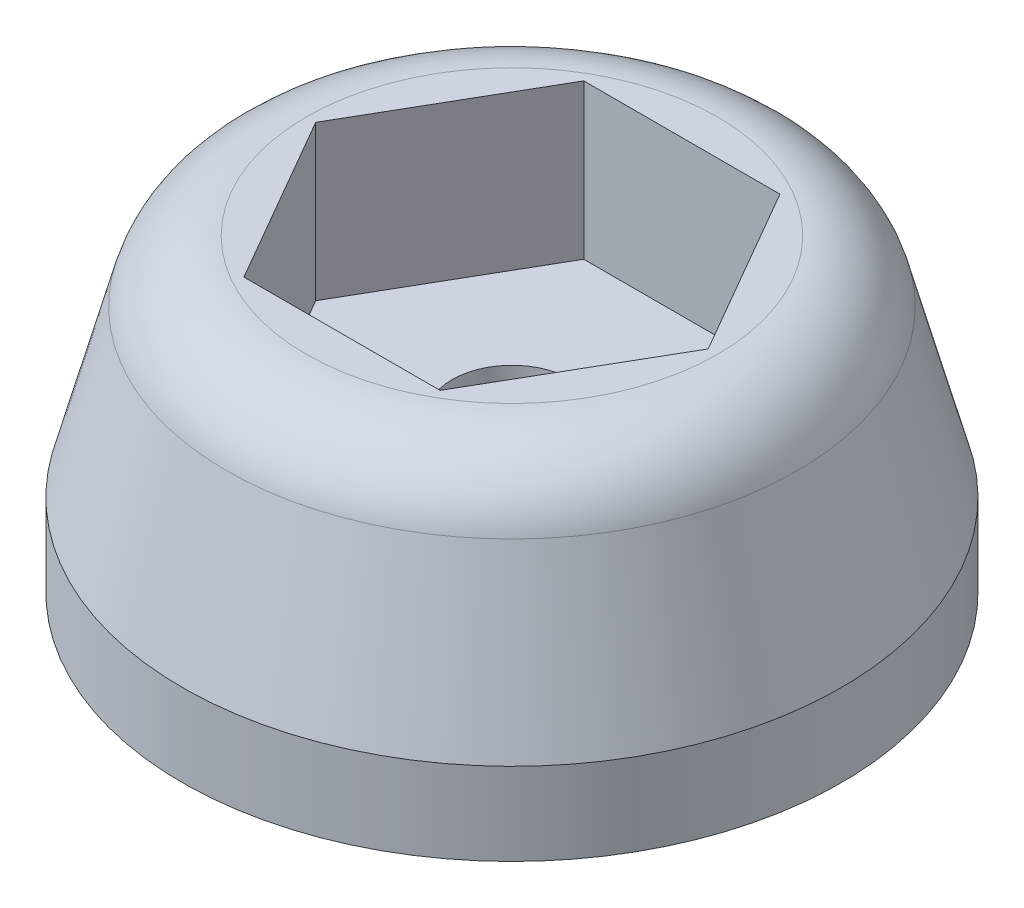
ISO-10303-21;
HEADER;
FILE_DESCRIPTION(('STEP AP214'),'2;1');
FILE_NAME('part.step','',(''),(''),'','','');
FILE_SCHEMA(('AUTOMOTIVE_DESIGN { 1 0 10303 214 1 1 1 1 }'));
ENDSEC;
DATA;
#1=APPLICATION_CONTEXT('core data for automotive mechanical design processes');
#2=APPLICATION_PROTOCOL_DEFINITION('international standard','automotive_design',2000,#1);
#3=PRODUCT_CONTEXT('',#1,'mechanical');
#4=PRODUCT('Part','Part','',(#3));
#5=PRODUCT_RELATED_PRODUCT_CATEGORY('part','',(#4));
#6=PRODUCT_DEFINITION_FORMATION('','',#4);
#7=PRODUCT_DEFINITION_CONTEXT('part definition',#1,'design');
#8=PRODUCT_DEFINITION('design','',#6,#7);
#9=PRODUCT_DEFINITION_SHAPE('','',#8);
#10=(LENGTH_UNIT() NAMED_UNIT(*) SI_UNIT(.MILLI.,.METRE.));
#11=(NAMED_UNIT(*) PLANE_ANGLE_UNIT() SI_UNIT($,.RADIAN.));
#12=(NAMED_UNIT(*) SI_UNIT($,.STERADIAN.) SOLID_ANGLE_UNIT());
#13=UNCERTAINTY_MEASURE_WITH_UNIT(LENGTH_MEASURE(1.E-05),#10,'distance_accuracy_value','');
#14=(GEOMETRIC_REPRESENTATION_CONTEXT(3) GLOBAL_UNCERTAINTY_ASSIGNED_CONTEXT((#13)) GLOBAL_UNIT_ASSIGNED_CONTEXT((#10,
#11,#12)) REPRESENTATION_CONTEXT('',''));
#15=CARTESIAN_POINT('',(0.,0.,0.));
#16=DIRECTION('',(0.,0.,1.));
#17=DIRECTION('',(1.,0.,0.));
#18=AXIS2_PLACEMENT_3D('',#15,#16,#17);
#19=CARTESIAN_POINT('',(0.,0.,0.));
#20=DIRECTION('',(0.,1.,0.));
#21=DIRECTION('',(-1.,0.,0.));
#22=AXIS2_PLACEMENT_3D('',#19,#20,#21);
#23=CYLINDRICAL_SURFACE('',#22,1.4732);
#24=CARTESIAN_POINT('',(0.,0.,0.));
#25=DIRECTION('',(0.,1.,0.));
#26=DIRECTION('',(-1.,0.,0.));
#27=AXIS2_PLACEMENT_3D('',#24,#25,#26);
#28=CIRCLE('',#27,1.4732);
#29=CARTESIAN_POINT('',(-1.4732,0.,0.));
#30=VERTEX_POINT('',#29);
#31=EDGE_CURVE('E11',#30,#30,#28,.T.);
#32=ORIENTED_EDGE('',*,*,#31,.F.);
#33=EDGE_LOOP('',(#32));
#34=FACE_BOUND('',#33,.T.);
#35=CARTESIAN_POINT('',(0.,3.81,0.));
#36=DIRECTION('',(0.,1.,0.));
#37=DIRECTION('',(-1.,0.,0.));
#38=AXIS2_PLACEMENT_3D('',#35,#36,#37);
#39=CIRCLE('',#38,1.4732);
#40=CARTESIAN_POINT('',(-1.4732,3.81,0.));
#41=VERTEX_POINT('',#40);
#42=EDGE_CURVE('E36',#41,#41,#39,.T.);
#43=ORIENTED_EDGE('',*,*,#42,.T.);
#44=EDGE_LOOP('',(#43));
#45=FACE_BOUND('',#44,.T.);
#46=ADVANCED_FACE('F33',(#34,#45),#23,.F.);
#47=CARTESIAN_POINT('',(-1.4732,0.,0.));
#48=DIRECTION('',(0.,-1.,0.));
#49=DIRECTION('',(1.,0.,0.));
#50=AXIS2_PLACEMENT_3D('',#47,#48,#49);
#51=PLANE('',#50);
#52=ORIENTED_EDGE('',*,*,#31,.T.);
#53=EDGE_LOOP('',(#52));
#54=FACE_BOUND('',#53,.T.);
#55=CARTESIAN_POINT('',(0.,0.,0.));
#56=DIRECTION('',(0.,1.,0.));
#57=DIRECTION('',(-1.,0.,0.));
#58=AXIS2_PLACEMENT_3D('',#55,#56,#57);
#59=CIRCLE('',#58,8.128);
#60=CARTESIAN_POINT('',(-8.128,0.,0.));
#61=VERTEX_POINT('',#60);
#62=EDGE_CURVE('E41',#61,#61,#59,.T.);
#63=ORIENTED_EDGE('',*,*,#62,.F.);
#64=EDGE_LOOP('',(#63));
#65=FACE_BOUND('',#64,.T.);
#66=ADVANCED_FACE('F155',(#54,#65),#51,.T.);
#67=CARTESIAN_POINT('',(0.,0.,0.));
#68=DIRECTION('',(0.,1.,0.));
#69=DIRECTION('',(-1.,0.,0.));
#70=AXIS2_PLACEMENT_3D('',#67,#68,#69);
#71=CYLINDRICAL_SURFACE('',#70,8.128);
#72=ORIENTED_EDGE('',*,*,#62,.T.);
#73=EDGE_LOOP('',(#72));
#74=FACE_BOUND('',#73,.T.);
#75=CARTESIAN_POINT('',(0.,2.032,0.));
#76=DIRECTION('',(0.,1.,0.));
#77=DIRECTION('',(-1.,0.,0.));
#78=AXIS2_PLACEMENT_3D('',#75,#76,#77);
#79=CIRCLE('',#78,8.128);
#80=CARTESIAN_POINT('',(-8.128,2.032,0.));
#81=VERTEX_POINT('',#80);
#82=EDGE_CURVE('E146',#81,#81,#79,.T.);
#83=ORIENTED_EDGE('',*,*,#82,.F.);
#84=EDGE_LOOP('',(#83));
#85=FACE_BOUND('',#84,.T.);
#86=ADVANCED_FACE('F152',(#74,#85),#71,.T.);
#87=CARTESIAN_POINT('',(0.,6.11392029964832,0.));
#88=DIRECTION('',(0.,-1.,0.));
#89=DIRECTION('',(1.,0.,0.));
#90=AXIS2_PLACEMENT_3D('',#87,#88,#89);
#91=CONICAL_SURFACE('',#90,7.03425275214102,0.26179938779915);
#92=ORIENTED_EDGE('',*,*,#82,.T.);
#93=EDGE_LOOP('',(#92));
#94=FACE_BOUND('',#93,.T.);
#95=CARTESIAN_POINT('',(0.,6.11392029964832,0.));
#96=DIRECTION('',(0.,1.,0.));
#97=DIRECTION('',(-1.,0.,0.));
#98=AXIS2_PLACEMENT_3D('',#95,#96,#97);
#99=CIRCLE('',#98,7.03425275214102);
#100=CARTESIAN_POINT('',(-7.03425275214102,6.11392029964832,0.));
#101=VERTEX_POINT('',#100);
#102=EDGE_CURVE('E143',#101,#101,#99,.T.);
#103=ORIENTED_EDGE('',*,*,#102,.F.);
#104=EDGE_LOOP('',(#103));
#105=FACE_BOUND('',#104,.T.);
#106=ADVANCED_FACE('F162',(#94,#105),#91,.T.);
#107=CARTESIAN_POINT('',(0.,5.588,0.));
#108=DIRECTION('',(0.,1.,0.));
#109=DIRECTION('',(-1.,0.,0.));
#110=AXIS2_PLACEMENT_3D('',#107,#108,#109);
#111=TOROIDAL_SURFACE('',#110,5.07149147312164,2.032);
#112=ORIENTED_EDGE('',*,*,#102,.T.);
#113=EDGE_LOOP('',(#112));
#114=FACE_BOUND('',#113,.T.);
#115=CARTESIAN_POINT('',(0.,7.62,0.));
#116=DIRECTION('',(0.,1.,0.));
#117=DIRECTION('',(-1.,0.,0.));
#118=AXIS2_PLACEMENT_3D('',#115,#116,#117);
#119=CIRCLE('',#118,5.07149147312164);
#120=CARTESIAN_POINT('',(-5.07149147312164,7.62,0.));
#121=VERTEX_POINT('',#120);
#122=EDGE_CURVE('E140',#121,#121,#119,.T.);
#123=ORIENTED_EDGE('',*,*,#122,.F.);
#124=EDGE_LOOP('',(#123));
#125=FACE_BOUND('',#124,.T.);
#126=ADVANCED_FACE('F168',(#114,#125),#111,.T.);
#127=CARTESIAN_POINT('',(-1.4732,7.62,0.));
#128=DIRECTION('',(0.,1.,0.));
#129=DIRECTION('',(-1.,0.,0.));
#130=AXIS2_PLACEMENT_3D('',#127,#128,#129);
#131=PLANE('',#130);
#132=DIRECTION('',(-0.5,0.,0.866025403784438));
#133=VECTOR('',#132,1.);
#134=CARTESIAN_POINT('',(-2.41967497817372,7.62,-4.191));
#135=LINE('',#134,#133);
#136=CARTESIAN_POINT('',(-2.41967497817372,7.62,-4.191));
#137=VERTEX_POINT('',#136);
#138=CARTESIAN_POINT('',(-4.83934995634744,7.62,0.));
#139=VERTEX_POINT('',#138);
#140=EDGE_CURVE('E48',#137,#139,#135,.T.);
#141=ORIENTED_EDGE('',*,*,#140,.F.);
#142=DIRECTION('',(-1.,0.,0.));
#143=VECTOR('',#142,1.);
#144=CARTESIAN_POINT('',(2.41967497817372,7.62,-4.191));
#145=LINE('',#144,#143);
#146=CARTESIAN_POINT('',(2.41967497817372,7.62,-4.191));
#147=VERTEX_POINT('',#146);
#148=EDGE_CURVE('E131',#147,#137,#145,.T.);
#149=ORIENTED_EDGE('',*,*,#148,.F.);
#150=DIRECTION('',(-0.5,0.,-0.866025403784439));
#151=VECTOR('',#150,1.);
#152=CARTESIAN_POINT('',(4.83934995634744,7.62,0.));
#153=LINE('',#152,#151);
#154=CARTESIAN_POINT('',(4.83934995634744,7.62,0.));
#155=VERTEX_POINT('',#154);
#156=EDGE_CURVE('E129',#155,#147,#153,.T.);
#157=ORIENTED_EDGE('',*,*,#156,.F.);
#158=DIRECTION('',(0.5,0.,-0.866025403784439));
#159=VECTOR('',#158,1.);
#160=CARTESIAN_POINT('',(2.41967497817372,7.62,4.191));
#161=LINE('',#160,#159);
#162=CARTESIAN_POINT('',(2.41967497817372,7.62,4.191));
#163=VERTEX_POINT('',#162);
#164=EDGE_CURVE('E96',#163,#155,#161,.T.);
#165=ORIENTED_EDGE('',*,*,#164,.F.);
#166=DIRECTION('',(1.,0.,0.));
#167=VECTOR('',#166,1.);
#168=CARTESIAN_POINT('',(-2.41967497817372,7.62,4.191));
#169=LINE('',#168,#167);
#170=CARTESIAN_POINT('',(-2.41967497817372,7.62,4.191));
#171=VERTEX_POINT('',#170);
#172=EDGE_CURVE('E125',#171,#163,#169,.T.);
#173=ORIENTED_EDGE('',*,*,#172,.F.);
#174=DIRECTION('',(0.5,0.,0.866025403784438));
#175=VECTOR('',#174,1.);
#176=CARTESIAN_POINT('',(-4.83934995634744,7.62,0.));
#177=LINE('',#176,#175);
#178=EDGE_CURVE('E122',#139,#171,#177,.T.);
#179=ORIENTED_EDGE('',*,*,#178,.F.);
#180=EDGE_LOOP('',(#141,#149,#157,#165,#173,#179));
#181=FACE_BOUND('',#180,.T.);
#182=ORIENTED_EDGE('',*,*,#122,.T.);
#183=EDGE_LOOP('',(#182));
#184=FACE_BOUND('',#183,.T.);
#185=ADVANCED_FACE('F172',(#181,#184),#131,.T.);
#186=CARTESIAN_POINT('',(-2.41967497817372,3.81,-4.191));
#187=DIRECTION('',(-0.866025403784439,0.,-0.5));
#188=DIRECTION('',(-0.5,0.,0.866025403784439));
#189=AXIS2_PLACEMENT_3D('',#186,#187,#188);
#190=PLANE('',#189);
#191=ORIENTED_EDGE('',*,*,#140,.T.);
#192=DIRECTION('',(0.,1.,0.));
#193=VECTOR('',#192,1.);
#194=CARTESIAN_POINT('',(-4.83934995634744,3.81,0.));
#195=LINE('',#194,#193);
#196=CARTESIAN_POINT('',(-4.83934995634744,3.81,0.));
#197=VERTEX_POINT('',#196);
#198=EDGE_CURVE('E78',#197,#139,#195,.T.);
#199=ORIENTED_EDGE('',*,*,#198,.F.);
#200=DIRECTION('',(-0.5,0.,0.866025403784438));
#201=VECTOR('',#200,1.);
#202=CARTESIAN_POINT('',(-2.41967497817372,3.81,-4.191));
#203=LINE('',#202,#201);
#204=CARTESIAN_POINT('',(-2.41967497817372,3.81,-4.191));
#205=VERTEX_POINT('',#204);
#206=EDGE_CURVE('E133',#205,#197,#203,.T.);
#207=ORIENTED_EDGE('',*,*,#206,.F.);
#208=DIRECTION('',(0.,1.,0.));
#209=VECTOR('',#208,1.);
#210=CARTESIAN_POINT('',(-2.41967497817372,3.81,-4.191));
#211=LINE('',#210,#209);
#212=EDGE_CURVE('E56',#205,#137,#211,.T.);
#213=ORIENTED_EDGE('',*,*,#212,.T.);
#214=EDGE_LOOP('',(#191,#199,#207,#213));
#215=FACE_BOUND('',#214,.T.);
#216=ADVANCED_FACE('F176',(#215),#190,.F.);
#217=CARTESIAN_POINT('',(2.41967497817372,3.81,-4.191));
#218=DIRECTION('',(0.,0.,-1.));
#219=DIRECTION('',(-1.,0.,0.));
#220=AXIS2_PLACEMENT_3D('',#217,#218,#219);
#221=PLANE('',#220);
#222=ORIENTED_EDGE('',*,*,#148,.T.);
#223=ORIENTED_EDGE('',*,*,#212,.F.);
#224=DIRECTION('',(-1.,0.,0.));
#225=VECTOR('',#224,1.);
#226=CARTESIAN_POINT('',(2.41967497817372,3.81,-4.191));
#227=LINE('',#226,#225);
#228=CARTESIAN_POINT('',(2.41967497817372,3.81,-4.191));
#229=VERTEX_POINT('',#228);
#230=EDGE_CURVE('E108',#229,#205,#227,.T.);
#231=ORIENTED_EDGE('',*,*,#230,.F.);
#232=DIRECTION('',(0.,1.,0.));
#233=VECTOR('',#232,1.);
#234=CARTESIAN_POINT('',(2.41967497817372,3.81,-4.191));
#235=LINE('',#234,#233);
#236=EDGE_CURVE('E100',#229,#147,#235,.T.);
#237=ORIENTED_EDGE('',*,*,#236,.T.);
#238=EDGE_LOOP('',(#222,#223,#231,#237));
#239=FACE_BOUND('',#238,.T.);
#240=ADVANCED_FACE('F180',(#239),#221,.F.);
#241=CARTESIAN_POINT('',(4.83934995634744,3.81,0.));
#242=DIRECTION('',(0.866025403784438,0.,-0.5));
#243=DIRECTION('',(-0.5,0.,-0.866025403784439));
#244=AXIS2_PLACEMENT_3D('',#241,#242,#243);
#245=PLANE('',#244);
#246=ORIENTED_EDGE('',*,*,#156,.T.);
#247=ORIENTED_EDGE('',*,*,#236,.F.);
#248=DIRECTION('',(-0.5,0.,-0.866025403784439));
#249=VECTOR('',#248,1.);
#250=CARTESIAN_POINT('',(4.83934995634744,3.81,0.));
#251=LINE('',#250,#249);
#252=CARTESIAN_POINT('',(4.83934995634744,3.81,0.));
#253=VERTEX_POINT('',#252);
#254=EDGE_CURVE('E104',#253,#229,#251,.T.);
#255=ORIENTED_EDGE('',*,*,#254,.F.);
#256=DIRECTION('',(0.,1.,0.));
#257=VECTOR('',#256,1.);
#258=CARTESIAN_POINT('',(4.83934995634744,3.81,0.));
#259=LINE('',#258,#257);
#260=EDGE_CURVE('E89',#253,#155,#259,.T.);
#261=ORIENTED_EDGE('',*,*,#260,.T.);
#262=EDGE_LOOP('',(#246,#247,#255,#261));
#263=FACE_BOUND('',#262,.T.);
#264=ADVANCED_FACE('F105',(#263),#245,.F.);
#265=CARTESIAN_POINT('',(2.41967497817372,3.81,4.191));
#266=DIRECTION('',(0.866025403784439,0.,0.5));
#267=DIRECTION('',(0.5,0.,-0.866025403784439));
#268=AXIS2_PLACEMENT_3D('',#265,#266,#267);
#269=PLANE('',#268);
#270=ORIENTED_EDGE('',*,*,#164,.T.);
#271=ORIENTED_EDGE('',*,*,#260,.F.);
#272=DIRECTION('',(0.5,0.,-0.866025403784439));
#273=VECTOR('',#272,1.);
#274=CARTESIAN_POINT('',(2.41967497817372,3.81,4.191));
#275=LINE('',#274,#273);
#276=CARTESIAN_POINT('',(2.41967497817372,3.81,4.191));
#277=VERTEX_POINT('',#276);
#278=EDGE_CURVE('E93',#277,#253,#275,.T.);
#279=ORIENTED_EDGE('',*,*,#278,.F.);
#280=DIRECTION('',(0.,1.,0.));
#281=VECTOR('',#280,1.);
#282=CARTESIAN_POINT('',(2.41967497817372,3.81,4.191));
#283=LINE('',#282,#281);
#284=EDGE_CURVE('E101',#277,#163,#283,.T.);
#285=ORIENTED_EDGE('',*,*,#284,.T.);
#286=EDGE_LOOP('',(#270,#271,#279,#285));
#287=FACE_BOUND('',#286,.T.);
#288=ADVANCED_FACE('F91',(#287),#269,.F.);
#289=CARTESIAN_POINT('',(-2.41967497817372,3.81,4.191));
#290=DIRECTION('',(0.,0.,1.));
#291=DIRECTION('',(1.,0.,0.));
#292=AXIS2_PLACEMENT_3D('',#289,#290,#291);
#293=PLANE('',#292);
#294=ORIENTED_EDGE('',*,*,#172,.T.);
#295=ORIENTED_EDGE('',*,*,#284,.F.);
#296=DIRECTION('',(1.,0.,0.));
#297=VECTOR('',#296,1.);
#298=CARTESIAN_POINT('',(-2.41967497817372,3.81,4.191));
#299=LINE('',#298,#297);
#300=CARTESIAN_POINT('',(-2.41967497817372,3.81,4.191));
#301=VERTEX_POINT('',#300);
#302=EDGE_CURVE('E114',#301,#277,#299,.T.);
#303=ORIENTED_EDGE('',*,*,#302,.F.);
#304=DIRECTION('',(0.,1.,0.));
#305=VECTOR('',#304,1.);
#306=CARTESIAN_POINT('',(-2.41967497817372,3.81,4.191));
#307=LINE('',#306,#305);
#308=EDGE_CURVE('E137',#301,#171,#307,.T.);
#309=ORIENTED_EDGE('',*,*,#308,.T.);
#310=EDGE_LOOP('',(#294,#295,#303,#309));
#311=FACE_BOUND('',#310,.T.);
#312=ADVANCED_FACE('F184',(#311),#293,.F.);
#313=CARTESIAN_POINT('',(-4.83934995634744,3.81,0.));
#314=DIRECTION('',(-0.866025403784438,0.,0.5));
#315=DIRECTION('',(0.5,0.,0.866025403784439));
#316=AXIS2_PLACEMENT_3D('',#313,#314,#315);
#317=PLANE('',#316);
#318=ORIENTED_EDGE('',*,*,#178,.T.);
#319=ORIENTED_EDGE('',*,*,#308,.F.);
#320=DIRECTION('',(0.5,0.,0.866025403784438));
#321=VECTOR('',#320,1.);
#322=CARTESIAN_POINT('',(-4.83934995634744,3.81,0.));
#323=LINE('',#322,#321);
#324=EDGE_CURVE('E116',#197,#301,#323,.T.);
#325=ORIENTED_EDGE('',*,*,#324,.F.);
#326=ORIENTED_EDGE('',*,*,#198,.T.);
#327=EDGE_LOOP('',(#318,#319,#325,#326));
#328=FACE_BOUND('',#327,.T.);
#329=ADVANCED_FACE('F181',(#328),#317,.F.);
#330=CARTESIAN_POINT('',(0.,3.81,0.));
#331=DIRECTION('',(0.,1.,0.));
#332=DIRECTION('',(-1.,0.,0.));
#333=AXIS2_PLACEMENT_3D('',#330,#331,#332);
#334=PLANE('',#333);
#335=ORIENTED_EDGE('',*,*,#42,.F.);
#336=EDGE_LOOP('',(#335));
#337=FACE_BOUND('',#336,.T.);
#338=ORIENTED_EDGE('',*,*,#206,.T.);
#339=ORIENTED_EDGE('',*,*,#324,.T.);
#340=ORIENTED_EDGE('',*,*,#302,.T.);
#341=ORIENTED_EDGE('',*,*,#278,.T.);
#342=ORIENTED_EDGE('',*,*,#254,.T.);
#343=ORIENTED_EDGE('',*,*,#230,.T.);
#344=EDGE_LOOP('',(#338,#339,#340,#341,#342,#343));
#345=FACE_BOUND('',#344,.T.);
#346=ADVANCED_FACE('F111',(#337,#345),#334,.T.);
#347=CLOSED_SHELL('',(#46,#66,#86,#106,#126,#185,#216,#240,#264,#288,#312,#329,#346));
#348=MANIFOLD_SOLID_BREP('B2',#347);
#349=ADVANCED_BREP_SHAPE_REPRESENTATION('',(#18,#348),#14);
#350=SHAPE_DEFINITION_REPRESENTATION(#9,#349);
ENDSEC;
END-ISO-10303-21;
